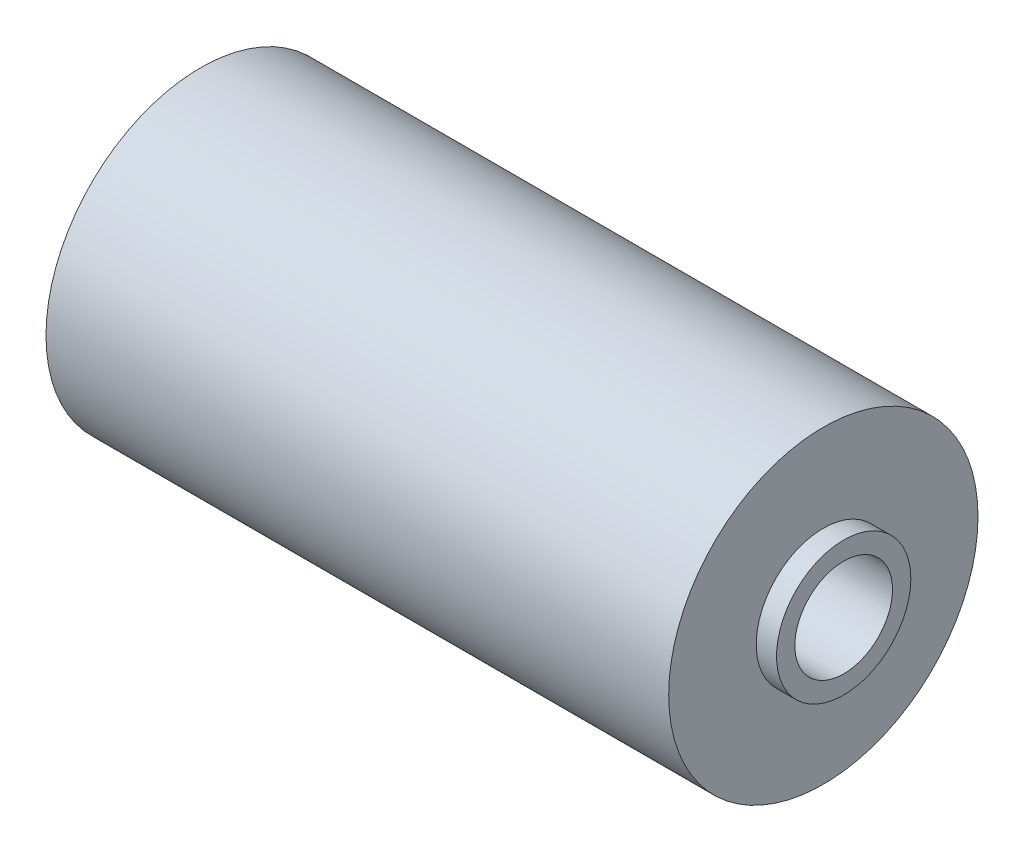
ISO-10303-21;
HEADER;
FILE_DESCRIPTION(('STEP AP214'),'2;1');
FILE_NAME('part.step','',(''),(''),'','','');
FILE_SCHEMA(('AUTOMOTIVE_DESIGN { 1 0 10303 214 1 1 1 1 }'));
ENDSEC;
DATA;
#1=APPLICATION_CONTEXT('core data for automotive mechanical design processes');
#2=APPLICATION_PROTOCOL_DEFINITION('international standard','automotive_design',2000,#1);
#3=PRODUCT_CONTEXT('',#1,'mechanical');
#4=PRODUCT('Part','Part','',(#3));
#5=PRODUCT_RELATED_PRODUCT_CATEGORY('part','',(#4));
#6=PRODUCT_DEFINITION_FORMATION('','',#4);
#7=PRODUCT_DEFINITION_CONTEXT('part definition',#1,'design');
#8=PRODUCT_DEFINITION('design','',#6,#7);
#9=PRODUCT_DEFINITION_SHAPE('','',#8);
#10=(LENGTH_UNIT() NAMED_UNIT(*) SI_UNIT(.MILLI.,.METRE.));
#11=(NAMED_UNIT(*) PLANE_ANGLE_UNIT() SI_UNIT($,.RADIAN.));
#12=(NAMED_UNIT(*) SI_UNIT($,.STERADIAN.) SOLID_ANGLE_UNIT());
#13=UNCERTAINTY_MEASURE_WITH_UNIT(LENGTH_MEASURE(1.E-05),#10,'distance_accuracy_value','');
#14=(GEOMETRIC_REPRESENTATION_CONTEXT(3) GLOBAL_UNCERTAINTY_ASSIGNED_CONTEXT((#13)) GLOBAL_UNIT_ASSIGNED_CONTEXT((#10,
#11,#12)) REPRESENTATION_CONTEXT('',''));
#15=CARTESIAN_POINT('',(0.,0.,0.));
#16=DIRECTION('',(0.,0.,1.));
#17=DIRECTION('',(1.,0.,0.));
#18=AXIS2_PLACEMENT_3D('',#15,#16,#17);
#19=CARTESIAN_POINT('',(81.5,0.,0.));
#20=DIRECTION('',(-1.,0.,0.));
#21=DIRECTION('',(0.,0.,1.));
#22=AXIS2_PLACEMENT_3D('',#19,#20,#21);
#23=CYLINDRICAL_SURFACE('',#22,16.5);
#24=CARTESIAN_POINT('',(76.5,0.,0.));
#25=DIRECTION('',(1.,0.,0.));
#26=DIRECTION('',(0.,0.,-1.));
#27=AXIS2_PLACEMENT_3D('',#24,#25,#26);
#28=CIRCLE('',#27,16.5);
#29=CARTESIAN_POINT('',(76.5,0.,-16.5));
#30=VERTEX_POINT('',#29);
#31=EDGE_CURVE('E59',#30,#30,#28,.T.);
#32=ORIENTED_EDGE('',*,*,#31,.T.);
#33=EDGE_LOOP('',(#32));
#34=FACE_BOUND('',#33,.T.);
#35=CARTESIAN_POINT('',(81.5,0.,0.));
#36=DIRECTION('',(1.,0.,0.));
#37=DIRECTION('',(0.,0.,-1.));
#38=AXIS2_PLACEMENT_3D('',#35,#36,#37);
#39=CIRCLE('',#38,16.5);
#40=CARTESIAN_POINT('',(81.5,0.,-16.5));
#41=VERTEX_POINT('',#40);
#42=EDGE_CURVE('E12',#41,#41,#39,.T.);
#43=ORIENTED_EDGE('',*,*,#42,.F.);
#44=EDGE_LOOP('',(#43));
#45=FACE_BOUND('',#44,.T.);
#46=ADVANCED_FACE('F43',(#34,#45),#23,.T.);
#47=CARTESIAN_POINT('',(81.5,0.,0.));
#48=DIRECTION('',(1.,0.,0.));
#49=DIRECTION('',(0.,0.,-1.));
#50=AXIS2_PLACEMENT_3D('',#47,#48,#49);
#51=PLANE('',#50);
#52=ORIENTED_EDGE('',*,*,#42,.T.);
#53=EDGE_LOOP('',(#52));
#54=FACE_BOUND('',#53,.T.);
#55=CARTESIAN_POINT('',(81.5,0.,0.));
#56=DIRECTION('',(1.,0.,0.));
#57=DIRECTION('',(0.,0.,-1.));
#58=AXIS2_PLACEMENT_3D('',#55,#56,#57);
#59=CIRCLE('',#58,12.);
#60=CARTESIAN_POINT('',(81.5,0.,-12.));
#61=VERTEX_POINT('',#60);
#62=EDGE_CURVE('E54',#61,#61,#59,.T.);
#63=ORIENTED_EDGE('',*,*,#62,.F.);
#64=EDGE_LOOP('',(#63));
#65=FACE_BOUND('',#64,.T.);
#66=ADVANCED_FACE('F84',(#54,#65),#51,.T.);
#67=CARTESIAN_POINT('',(76.5,0.,0.));
#68=DIRECTION('',(1.,0.,0.));
#69=DIRECTION('',(0.,0.,-1.));
#70=AXIS2_PLACEMENT_3D('',#67,#68,#69);
#71=PLANE('',#70);
#72=ORIENTED_EDGE('',*,*,#31,.F.);
#73=EDGE_LOOP('',(#72));
#74=FACE_BOUND('',#73,.T.);
#75=CARTESIAN_POINT('',(76.5,0.,0.));
#76=DIRECTION('',(1.,0.,0.));
#77=DIRECTION('',(0.,0.,-1.));
#78=AXIS2_PLACEMENT_3D('',#75,#76,#77);
#79=CIRCLE('',#78,38.);
#80=CARTESIAN_POINT('',(76.5,0.,-38.));
#81=VERTEX_POINT('',#80);
#82=EDGE_CURVE('E67',#81,#81,#79,.F.);
#83=ORIENTED_EDGE('',*,*,#82,.F.);
#84=EDGE_LOOP('',(#83));
#85=FACE_BOUND('',#84,.T.);
#86=ADVANCED_FACE('F82',(#74,#85),#71,.T.);
#87=CARTESIAN_POINT('',(-76.5,0.,0.));
#88=DIRECTION('',(-1.,0.,0.));
#89=DIRECTION('',(0.,0.,1.));
#90=AXIS2_PLACEMENT_3D('',#87,#88,#89);
#91=PLANE('',#90);
#92=CARTESIAN_POINT('',(-76.5,0.,0.));
#93=DIRECTION('',(-1.,0.,0.));
#94=DIRECTION('',(0.,0.,1.));
#95=AXIS2_PLACEMENT_3D('',#92,#93,#94);
#96=CIRCLE('',#95,16.5);
#97=CARTESIAN_POINT('',(-76.5,0.,16.5));
#98=VERTEX_POINT('',#97);
#99=EDGE_CURVE('E64',#98,#98,#96,.T.);
#100=ORIENTED_EDGE('',*,*,#99,.F.);
#101=EDGE_LOOP('',(#100));
#102=FACE_BOUND('',#101,.T.);
#103=CARTESIAN_POINT('',(-76.5,0.,0.));
#104=DIRECTION('',(-1.,0.,0.));
#105=DIRECTION('',(0.,0.,1.));
#106=AXIS2_PLACEMENT_3D('',#103,#104,#105);
#107=CIRCLE('',#106,38.);
#108=CARTESIAN_POINT('',(-76.5,0.,38.));
#109=VERTEX_POINT('',#108);
#110=EDGE_CURVE('E70',#109,#109,#107,.T.);
#111=ORIENTED_EDGE('',*,*,#110,.T.);
#112=EDGE_LOOP('',(#111));
#113=FACE_BOUND('',#112,.T.);
#114=ADVANCED_FACE('F74',(#102,#113),#91,.T.);
#115=CARTESIAN_POINT('',(188.980230740355,0.,0.));
#116=DIRECTION('',(-1.,0.,0.));
#117=DIRECTION('',(0.,0.,1.));
#118=AXIS2_PLACEMENT_3D('',#115,#116,#117);
#119=CYLINDRICAL_SURFACE('',#118,38.);
#120=ORIENTED_EDGE('',*,*,#110,.F.);
#121=EDGE_LOOP('',(#120));
#122=FACE_BOUND('',#121,.T.);
#123=ORIENTED_EDGE('',*,*,#82,.T.);
#124=EDGE_LOOP('',(#123));
#125=FACE_BOUND('',#124,.T.);
#126=ADVANCED_FACE('F76',(#122,#125),#119,.T.);
#127=ORIENTED_EDGE('',*,*,#99,.T.);
#128=EDGE_LOOP('',(#127));
#129=FACE_BOUND('',#128,.T.);
#130=CARTESIAN_POINT('',(-81.5,0.,0.));
#131=DIRECTION('',(1.,0.,0.));
#132=DIRECTION('',(0.,0.,-1.));
#133=AXIS2_PLACEMENT_3D('',#130,#131,#132);
#134=CIRCLE('',#133,16.5);
#135=CARTESIAN_POINT('',(-81.5,0.,-16.5));
#136=VERTEX_POINT('',#135);
#137=EDGE_CURVE('E47',#136,#136,#134,.T.);
#138=ORIENTED_EDGE('',*,*,#137,.T.);
#139=EDGE_LOOP('',(#138));
#140=FACE_BOUND('',#139,.T.);
#141=ADVANCED_FACE('F45',(#129,#140),#23,.T.);
#142=CARTESIAN_POINT('',(-81.5,0.,0.));
#143=DIRECTION('',(1.,0.,0.));
#144=DIRECTION('',(0.,0.,-1.));
#145=AXIS2_PLACEMENT_3D('',#142,#143,#144);
#146=PLANE('',#145);
#147=ORIENTED_EDGE('',*,*,#137,.F.);
#148=EDGE_LOOP('',(#147));
#149=FACE_BOUND('',#148,.T.);
#150=CARTESIAN_POINT('',(-81.5,0.,0.));
#151=DIRECTION('',(1.,0.,0.));
#152=DIRECTION('',(0.,0.,-1.));
#153=AXIS2_PLACEMENT_3D('',#150,#151,#152);
#154=CIRCLE('',#153,12.);
#155=CARTESIAN_POINT('',(-81.5,0.,-12.));
#156=VERTEX_POINT('',#155);
#157=EDGE_CURVE('E56',#156,#156,#154,.T.);
#158=ORIENTED_EDGE('',*,*,#157,.T.);
#159=EDGE_LOOP('',(#158));
#160=FACE_BOUND('',#159,.T.);
#161=ADVANCED_FACE('F102',(#149,#160),#146,.F.);
#162=CARTESIAN_POINT('',(81.5,0.,0.));
#163=DIRECTION('',(-1.,0.,0.));
#164=DIRECTION('',(0.,0.,1.));
#165=AXIS2_PLACEMENT_3D('',#162,#163,#164);
#166=CYLINDRICAL_SURFACE('',#165,12.);
#167=ORIENTED_EDGE('',*,*,#157,.F.);
#168=EDGE_LOOP('',(#167));
#169=FACE_BOUND('',#168,.T.);
#170=ORIENTED_EDGE('',*,*,#62,.T.);
#171=EDGE_LOOP('',(#170));
#172=FACE_BOUND('',#171,.T.);
#173=ADVANCED_FACE('F107',(#169,#172),#166,.F.);
#174=CLOSED_SHELL('',(#46,#66,#86,#114,#126,#141,#161,#173));
#175=MANIFOLD_SOLID_BREP('B2',#174);
#176=ADVANCED_BREP_SHAPE_REPRESENTATION('',(#18,#175),#14);
#177=SHAPE_DEFINITION_REPRESENTATION(#9,#176);
ENDSEC;
END-ISO-10303-21;
